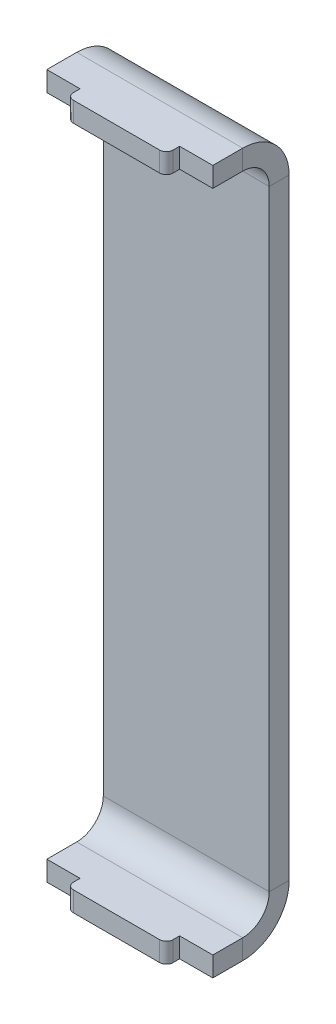
ISO-10303-21;
HEADER;
FILE_DESCRIPTION(('STEP AP214'),'2;1');
FILE_NAME('part.step','',(''),(''),'','','');
FILE_SCHEMA(('AUTOMOTIVE_DESIGN { 1 0 10303 214 1 1 1 1 }'));
ENDSEC;
DATA;
#1=APPLICATION_CONTEXT('core data for automotive mechanical design processes');
#2=APPLICATION_PROTOCOL_DEFINITION('international standard','automotive_design',2000,#1);
#3=PRODUCT_CONTEXT('',#1,'mechanical');
#4=PRODUCT('Part','Part','',(#3));
#5=PRODUCT_RELATED_PRODUCT_CATEGORY('part','',(#4));
#6=PRODUCT_DEFINITION_FORMATION('','',#4);
#7=PRODUCT_DEFINITION_CONTEXT('part definition',#1,'design');
#8=PRODUCT_DEFINITION('design','',#6,#7);
#9=PRODUCT_DEFINITION_SHAPE('','',#8);
#10=(LENGTH_UNIT() NAMED_UNIT(*) SI_UNIT(.MILLI.,.METRE.));
#11=(NAMED_UNIT(*) PLANE_ANGLE_UNIT() SI_UNIT($,.RADIAN.));
#12=(NAMED_UNIT(*) SI_UNIT($,.STERADIAN.) SOLID_ANGLE_UNIT());
#13=UNCERTAINTY_MEASURE_WITH_UNIT(LENGTH_MEASURE(1.E-05),#10,'distance_accuracy_value','');
#14=(GEOMETRIC_REPRESENTATION_CONTEXT(3) GLOBAL_UNCERTAINTY_ASSIGNED_CONTEXT((#13)) GLOBAL_UNIT_ASSIGNED_CONTEXT((#10,
#11,#12)) REPRESENTATION_CONTEXT('',''));
#15=CARTESIAN_POINT('',(0.,0.,0.));
#16=DIRECTION('',(0.,0.,1.));
#17=DIRECTION('',(1.,0.,0.));
#18=AXIS2_PLACEMENT_3D('',#15,#16,#17);
#19=CARTESIAN_POINT('',(0.,96.,-6.50000000000001));
#20=DIRECTION('',(-1.,0.,0.));
#21=DIRECTION('',(0.,0.,1.));
#22=AXIS2_PLACEMENT_3D('',#19,#20,#21);
#23=PLANE('',#22);
#24=DIRECTION('',(0.,0.,-1.));
#25=VECTOR('',#24,1.);
#26=CARTESIAN_POINT('',(0.,96.,-13.5));
#27=LINE('',#26,#25);
#28=CARTESIAN_POINT('',(0.,96.,-10.5));
#29=VERTEX_POINT('',#28);
#30=CARTESIAN_POINT('',(0.,96.,-13.5));
#31=VERTEX_POINT('',#30);
#32=EDGE_CURVE('E11',#29,#31,#27,.T.);
#33=ORIENTED_EDGE('',*,*,#32,.F.);
#34=CARTESIAN_POINT('',(0.,96.,-6.50000000000001));
#35=DIRECTION('',(-1.,0.,0.));
#36=DIRECTION('',(0.,0.,1.));
#37=AXIS2_PLACEMENT_3D('',#34,#35,#36);
#38=CIRCLE('',#37,4.);
#39=CARTESIAN_POINT('',(0.,100.,-6.50000000000002));
#40=VERTEX_POINT('',#39);
#41=EDGE_CURVE('E144',#29,#40,#38,.F.);
#42=ORIENTED_EDGE('',*,*,#41,.T.);
#43=DIRECTION('',(0.,1.,0.));
#44=VECTOR('',#43,1.);
#45=CARTESIAN_POINT('',(0.,103.,-6.50000000000001));
#46=LINE('',#45,#44);
#47=CARTESIAN_POINT('',(0.,103.,-6.50000000000001));
#48=VERTEX_POINT('',#47);
#49=EDGE_CURVE('E56',#40,#48,#46,.T.);
#50=ORIENTED_EDGE('',*,*,#49,.T.);
#51=CARTESIAN_POINT('',(0.,96.,-6.50000000000001));
#52=DIRECTION('',(1.,0.,0.));
#53=DIRECTION('',(0.,0.,-1.));
#54=AXIS2_PLACEMENT_3D('',#51,#52,#53);
#55=CIRCLE('',#54,7.);
#56=EDGE_CURVE('E147',#31,#48,#55,.T.);
#57=ORIENTED_EDGE('',*,*,#56,.F.);
#58=EDGE_LOOP('',(#33,#42,#50,#57));
#59=FACE_BOUND('',#58,.T.);
#60=ADVANCED_FACE('F45',(#59),#23,.T.);
#61=CARTESIAN_POINT('',(0.,103.,-10.5));
#62=DIRECTION('',(1.,0.,0.));
#63=DIRECTION('',(0.,0.,1.));
#64=AXIS2_PLACEMENT_3D('',#61,#62,#63);
#65=PLANE('',#64);
#66=ORIENTED_EDGE('',*,*,#49,.F.);
#67=DIRECTION('',(0.,0.,-1.));
#68=VECTOR('',#67,1.);
#69=CARTESIAN_POINT('',(0.,100.,-10.5));
#70=LINE('',#69,#68);
#71=CARTESIAN_POINT('',(0.,100.,-2.00000000000024));
#72=VERTEX_POINT('',#71);
#73=EDGE_CURVE('E398',#40,#72,#70,.F.);
#74=ORIENTED_EDGE('',*,*,#73,.T.);
#75=DIRECTION('',(0.,1.,0.));
#76=VECTOR('',#75,1.);
#77=CARTESIAN_POINT('',(0.,103.,-2.00000000000023));
#78=LINE('',#77,#76);
#79=CARTESIAN_POINT('',(0.,103.,-2.00000000000023));
#80=VERTEX_POINT('',#79);
#81=EDGE_CURVE('E268',#72,#80,#78,.T.);
#82=ORIENTED_EDGE('',*,*,#81,.T.);
#83=DIRECTION('',(0.,0.,1.));
#84=VECTOR('',#83,1.);
#85=CARTESIAN_POINT('',(0.,103.,-10.5));
#86=LINE('',#85,#84);
#87=EDGE_CURVE('E294',#48,#80,#86,.T.);
#88=ORIENTED_EDGE('',*,*,#87,.F.);
#89=EDGE_LOOP('',(#66,#74,#82,#88));
#90=FACE_BOUND('',#89,.T.);
#91=ADVANCED_FACE('F295',(#90),#65,.F.);
#92=CARTESIAN_POINT('',(0.,103.,-1.99999999999991));
#93=DIRECTION('',(0.,0.,1.));
#94=DIRECTION('',(-1.,0.,0.));
#95=AXIS2_PLACEMENT_3D('',#92,#93,#94);
#96=PLANE('',#95);
#97=ORIENTED_EDGE('',*,*,#81,.F.);
#98=DIRECTION('',(1.,0.,0.));
#99=VECTOR('',#98,1.);
#100=CARTESIAN_POINT('',(25.,100.,-2.00000000000024));
#101=LINE('',#100,#99);
#102=CARTESIAN_POINT('',(5.,100.,-2.00000000000024));
#103=VERTEX_POINT('',#102);
#104=EDGE_CURVE('E467',#103,#72,#101,.F.);
#105=ORIENTED_EDGE('',*,*,#104,.F.);
#106=DIRECTION('',(0.,1.,0.));
#107=VECTOR('',#106,1.);
#108=CARTESIAN_POINT('',(5.,103.,-2.00000000000023));
#109=LINE('',#108,#107);
#110=CARTESIAN_POINT('',(5.,103.,-2.00000000000023));
#111=VERTEX_POINT('',#110);
#112=EDGE_CURVE('E264',#103,#111,#109,.T.);
#113=ORIENTED_EDGE('',*,*,#112,.T.);
#114=DIRECTION('',(-1.,0.,0.));
#115=VECTOR('',#114,1.);
#116=CARTESIAN_POINT('',(0.,103.,-1.99999999999991));
#117=LINE('',#116,#115);
#118=EDGE_CURVE('E300',#111,#80,#117,.T.);
#119=ORIENTED_EDGE('',*,*,#118,.T.);
#120=EDGE_LOOP('',(#97,#105,#113,#119));
#121=FACE_BOUND('',#120,.T.);
#122=ADVANCED_FACE('F478',(#121),#96,.T.);
#123=CARTESIAN_POINT('',(5.,103.,4.08429320687734E-13));
#124=DIRECTION('',(-1.,0.,0.));
#125=DIRECTION('',(0.,0.,-1.));
#126=AXIS2_PLACEMENT_3D('',#123,#124,#125);
#127=PLANE('',#126);
#128=ORIENTED_EDGE('',*,*,#112,.F.);
#129=DIRECTION('',(0.,0.,-1.));
#130=VECTOR('',#129,1.);
#131=CARTESIAN_POINT('',(5.,100.,-10.5));
#132=LINE('',#131,#130);
#133=CARTESIAN_POINT('',(5.,100.,-1.00000000000001));
#134=VERTEX_POINT('',#133);
#135=EDGE_CURVE('E187',#134,#103,#132,.T.);
#136=ORIENTED_EDGE('',*,*,#135,.F.);
#137=DIRECTION('',(0.,1.,0.));
#138=VECTOR('',#137,1.);
#139=CARTESIAN_POINT('',(5.,103.,-1.));
#140=LINE('',#139,#138);
#141=CARTESIAN_POINT('',(5.,103.,-1.));
#142=VERTEX_POINT('',#141);
#143=EDGE_CURVE('E260',#134,#142,#140,.T.);
#144=ORIENTED_EDGE('',*,*,#143,.T.);
#145=DIRECTION('',(0.,0.,-1.));
#146=VECTOR('',#145,1.);
#147=CARTESIAN_POINT('',(5.,103.,4.08429320687734E-13));
#148=LINE('',#147,#146);
#149=EDGE_CURVE('E319',#142,#111,#148,.T.);
#150=ORIENTED_EDGE('',*,*,#149,.T.);
#151=EDGE_LOOP('',(#128,#136,#144,#150));
#152=FACE_BOUND('',#151,.T.);
#153=ADVANCED_FACE('F486',(#152),#127,.T.);
#154=CARTESIAN_POINT('',(6.,103.,-1.));
#155=DIRECTION('',(0.,-1.,0.));
#156=DIRECTION('',(0.,0.,-1.));
#157=AXIS2_PLACEMENT_3D('',#154,#155,#156);
#158=CYLINDRICAL_SURFACE('',#157,1.);
#159=ORIENTED_EDGE('',*,*,#143,.F.);
#160=CARTESIAN_POINT('',(6.,100.,-1.00000000000001));
#161=DIRECTION('',(0.,-1.,0.));
#162=DIRECTION('',(0.,0.,-1.));
#163=AXIS2_PLACEMENT_3D('',#160,#161,#162);
#164=CIRCLE('',#163,1.);
#165=CARTESIAN_POINT('',(6.,100.,0.));
#166=VERTEX_POINT('',#165);
#167=EDGE_CURVE('E182',#134,#166,#164,.F.);
#168=ORIENTED_EDGE('',*,*,#167,.T.);
#169=DIRECTION('',(0.,1.,0.));
#170=VECTOR('',#169,1.);
#171=CARTESIAN_POINT('',(6.,103.,0.));
#172=LINE('',#171,#170);
#173=CARTESIAN_POINT('',(6.,103.,0.));
#174=VERTEX_POINT('',#173);
#175=EDGE_CURVE('E256',#166,#174,#172,.T.);
#176=ORIENTED_EDGE('',*,*,#175,.T.);
#177=CARTESIAN_POINT('',(6.,103.,-1.));
#178=DIRECTION('',(0.,-1.,0.));
#179=DIRECTION('',(0.,0.,-1.));
#180=AXIS2_PLACEMENT_3D('',#177,#178,#179);
#181=CIRCLE('',#180,1.);
#182=EDGE_CURVE('E323',#142,#174,#181,.F.);
#183=ORIENTED_EDGE('',*,*,#182,.F.);
#184=EDGE_LOOP('',(#159,#168,#176,#183));
#185=FACE_BOUND('',#184,.T.);
#186=ADVANCED_FACE('F490',(#185),#158,.T.);
#187=CARTESIAN_POINT('',(25.,103.,0.));
#188=DIRECTION('',(0.,0.,1.));
#189=DIRECTION('',(-1.,0.,0.));
#190=AXIS2_PLACEMENT_3D('',#187,#188,#189);
#191=PLANE('',#190);
#192=ORIENTED_EDGE('',*,*,#175,.F.);
#193=DIRECTION('',(1.,0.,0.));
#194=VECTOR('',#193,1.);
#195=CARTESIAN_POINT('',(25.,100.,0.));
#196=LINE('',#195,#194);
#197=CARTESIAN_POINT('',(19.,100.,0.));
#198=VERTEX_POINT('',#197);
#199=EDGE_CURVE('E460',#198,#166,#196,.F.);
#200=ORIENTED_EDGE('',*,*,#199,.F.);
#201=DIRECTION('',(0.,1.,0.));
#202=VECTOR('',#201,1.);
#203=CARTESIAN_POINT('',(19.,103.,0.));
#204=LINE('',#203,#202);
#205=CARTESIAN_POINT('',(19.,103.,0.));
#206=VERTEX_POINT('',#205);
#207=EDGE_CURVE('E252',#198,#206,#204,.T.);
#208=ORIENTED_EDGE('',*,*,#207,.T.);
#209=DIRECTION('',(-1.,0.,0.));
#210=VECTOR('',#209,1.);
#211=CARTESIAN_POINT('',(25.,103.,0.));
#212=LINE('',#211,#210);
#213=EDGE_CURVE('E440',#206,#174,#212,.T.);
#214=ORIENTED_EDGE('',*,*,#213,.T.);
#215=EDGE_LOOP('',(#192,#200,#208,#214));
#216=FACE_BOUND('',#215,.T.);
#217=ADVANCED_FACE('F494',(#216),#191,.T.);
#218=CARTESIAN_POINT('',(19.,103.,-1.));
#219=DIRECTION('',(0.,-1.,0.));
#220=DIRECTION('',(0.,0.,-1.));
#221=AXIS2_PLACEMENT_3D('',#218,#219,#220);
#222=CYLINDRICAL_SURFACE('',#221,1.);
#223=ORIENTED_EDGE('',*,*,#207,.F.);
#224=CARTESIAN_POINT('',(19.,100.,-1.00000000000001));
#225=DIRECTION('',(0.,-1.,0.));
#226=DIRECTION('',(0.,0.,-1.));
#227=AXIS2_PLACEMENT_3D('',#224,#225,#226);
#228=CIRCLE('',#227,1.);
#229=CARTESIAN_POINT('',(20.,100.,-1.00000000000001));
#230=VERTEX_POINT('',#229);
#231=EDGE_CURVE('E456',#198,#230,#228,.F.);
#232=ORIENTED_EDGE('',*,*,#231,.T.);
#233=DIRECTION('',(0.,1.,0.));
#234=VECTOR('',#233,1.);
#235=CARTESIAN_POINT('',(20.,103.,-1.));
#236=LINE('',#235,#234);
#237=CARTESIAN_POINT('',(20.,103.,-1.));
#238=VERTEX_POINT('',#237);
#239=EDGE_CURVE('E248',#230,#238,#236,.T.);
#240=ORIENTED_EDGE('',*,*,#239,.T.);
#241=CARTESIAN_POINT('',(19.,103.,-1.));
#242=DIRECTION('',(0.,-1.,0.));
#243=DIRECTION('',(0.,0.,-1.));
#244=AXIS2_PLACEMENT_3D('',#241,#242,#243);
#245=CIRCLE('',#244,1.);
#246=EDGE_CURVE('E501',#206,#238,#245,.F.);
#247=ORIENTED_EDGE('',*,*,#246,.F.);
#248=EDGE_LOOP('',(#223,#232,#240,#247));
#249=FACE_BOUND('',#248,.T.);
#250=ADVANCED_FACE('F507',(#249),#222,.T.);
#251=CARTESIAN_POINT('',(20.,103.,4.08403469772825E-13));
#252=DIRECTION('',(1.,0.,0.));
#253=DIRECTION('',(0.,0.,1.));
#254=AXIS2_PLACEMENT_3D('',#251,#252,#253);
#255=PLANE('',#254);
#256=ORIENTED_EDGE('',*,*,#239,.F.);
#257=DIRECTION('',(0.,0.,-1.));
#258=VECTOR('',#257,1.);
#259=CARTESIAN_POINT('',(20.,100.,-10.5));
#260=LINE('',#259,#258);
#261=CARTESIAN_POINT('',(20.,100.,-2.00000000000024));
#262=VERTEX_POINT('',#261);
#263=EDGE_CURVE('E452',#262,#230,#260,.F.);
#264=ORIENTED_EDGE('',*,*,#263,.F.);
#265=DIRECTION('',(0.,1.,0.));
#266=VECTOR('',#265,1.);
#267=CARTESIAN_POINT('',(20.,103.,-2.00000000000023));
#268=LINE('',#267,#266);
#269=CARTESIAN_POINT('',(20.,103.,-2.00000000000023));
#270=VERTEX_POINT('',#269);
#271=EDGE_CURVE('E244',#262,#270,#268,.T.);
#272=ORIENTED_EDGE('',*,*,#271,.T.);
#273=DIRECTION('',(0.,0.,1.));
#274=VECTOR('',#273,1.);
#275=CARTESIAN_POINT('',(20.,103.,4.08403469772825E-13));
#276=LINE('',#275,#274);
#277=EDGE_CURVE('E509',#270,#238,#276,.T.);
#278=ORIENTED_EDGE('',*,*,#277,.T.);
#279=EDGE_LOOP('',(#256,#264,#272,#278));
#280=FACE_BOUND('',#279,.T.);
#281=ADVANCED_FACE('F631',(#280),#255,.T.);
#282=CARTESIAN_POINT('',(25.,103.,-1.99999999999991));
#283=DIRECTION('',(0.,0.,1.));
#284=DIRECTION('',(-1.,0.,0.));
#285=AXIS2_PLACEMENT_3D('',#282,#283,#284);
#286=PLANE('',#285);
#287=ORIENTED_EDGE('',*,*,#271,.F.);
#288=DIRECTION('',(1.,0.,0.));
#289=VECTOR('',#288,1.);
#290=CARTESIAN_POINT('',(25.,100.,-1.99999999999992));
#291=LINE('',#290,#289);
#292=CARTESIAN_POINT('',(25.,100.,-1.99999999999992));
#293=VERTEX_POINT('',#292);
#294=EDGE_CURVE('E448',#293,#262,#291,.F.);
#295=ORIENTED_EDGE('',*,*,#294,.F.);
#296=DIRECTION('',(0.,1.,0.));
#297=VECTOR('',#296,1.);
#298=CARTESIAN_POINT('',(25.,103.,-1.99999999999991));
#299=LINE('',#298,#297);
#300=CARTESIAN_POINT('',(25.,103.,-1.99999999999991));
#301=VERTEX_POINT('',#300);
#302=EDGE_CURVE('E240',#293,#301,#299,.T.);
#303=ORIENTED_EDGE('',*,*,#302,.T.);
#304=DIRECTION('',(-1.,0.,0.));
#305=VECTOR('',#304,1.);
#306=CARTESIAN_POINT('',(25.,103.,-1.99999999999991));
#307=LINE('',#306,#305);
#308=EDGE_CURVE('E313',#301,#270,#307,.T.);
#309=ORIENTED_EDGE('',*,*,#308,.T.);
#310=EDGE_LOOP('',(#287,#295,#303,#309));
#311=FACE_BOUND('',#310,.T.);
#312=ADVANCED_FACE('F519',(#311),#286,.T.);
#313=CARTESIAN_POINT('',(25.,103.,-10.5));
#314=DIRECTION('',(1.,0.,0.));
#315=DIRECTION('',(0.,0.,1.));
#316=AXIS2_PLACEMENT_3D('',#313,#314,#315);
#317=PLANE('',#316);
#318=ORIENTED_EDGE('',*,*,#302,.F.);
#319=DIRECTION('',(0.,0.,-1.));
#320=VECTOR('',#319,1.);
#321=CARTESIAN_POINT('',(25.,100.,-10.5));
#322=LINE('',#321,#320);
#323=CARTESIAN_POINT('',(25.,100.,-6.50000000000002));
#324=VERTEX_POINT('',#323);
#325=EDGE_CURVE('E399',#324,#293,#322,.F.);
#326=ORIENTED_EDGE('',*,*,#325,.F.);
#327=DIRECTION('',(0.,1.,0.));
#328=VECTOR('',#327,1.);
#329=CARTESIAN_POINT('',(25.,103.,-6.50000000000001));
#330=LINE('',#329,#328);
#331=CARTESIAN_POINT('',(25.,103.,-6.50000000000001));
#332=VERTEX_POINT('',#331);
#333=EDGE_CURVE('E236',#324,#332,#330,.T.);
#334=ORIENTED_EDGE('',*,*,#333,.T.);
#335=DIRECTION('',(0.,0.,1.));
#336=VECTOR('',#335,1.);
#337=CARTESIAN_POINT('',(25.,103.,-10.5));
#338=LINE('',#337,#336);
#339=EDGE_CURVE('E307',#332,#301,#338,.T.);
#340=ORIENTED_EDGE('',*,*,#339,.T.);
#341=EDGE_LOOP('',(#318,#326,#334,#340));
#342=FACE_BOUND('',#341,.T.);
#343=ADVANCED_FACE('F525',(#342),#317,.T.);
#344=CARTESIAN_POINT('',(25.,96.,-6.50000000000001));
#345=DIRECTION('',(-1.,0.,0.));
#346=DIRECTION('',(0.,0.,1.));
#347=AXIS2_PLACEMENT_3D('',#344,#345,#346);
#348=PLANE('',#347);
#349=ORIENTED_EDGE('',*,*,#333,.F.);
#350=CARTESIAN_POINT('',(25.,96.,-6.50000000000001));
#351=DIRECTION('',(-1.,0.,0.));
#352=DIRECTION('',(0.,0.,1.));
#353=AXIS2_PLACEMENT_3D('',#350,#351,#352);
#354=CIRCLE('',#353,4.);
#355=CARTESIAN_POINT('',(25.,96.,-10.5));
#356=VERTEX_POINT('',#355);
#357=EDGE_CURVE('E175',#356,#324,#354,.F.);
#358=ORIENTED_EDGE('',*,*,#357,.F.);
#359=DIRECTION('',(0.,0.,-1.));
#360=VECTOR('',#359,1.);
#361=CARTESIAN_POINT('',(25.,96.,-13.5));
#362=LINE('',#361,#360);
#363=CARTESIAN_POINT('',(25.,96.,-13.5));
#364=VERTEX_POINT('',#363);
#365=EDGE_CURVE('E232',#356,#364,#362,.T.);
#366=ORIENTED_EDGE('',*,*,#365,.T.);
#367=CARTESIAN_POINT('',(25.,96.,-6.50000000000001));
#368=DIRECTION('',(1.,0.,0.));
#369=DIRECTION('',(0.,0.,-1.));
#370=AXIS2_PLACEMENT_3D('',#367,#368,#369);
#371=CIRCLE('',#370,7.);
#372=EDGE_CURVE('E290',#364,#332,#371,.T.);
#373=ORIENTED_EDGE('',*,*,#372,.T.);
#374=EDGE_LOOP('',(#349,#358,#366,#373));
#375=FACE_BOUND('',#374,.T.);
#376=ADVANCED_FACE('F529',(#375),#348,.F.);
#377=CARTESIAN_POINT('',(25.,100.,-13.5));
#378=DIRECTION('',(1.,0.,0.));
#379=DIRECTION('',(0.,1.,0.));
#380=AXIS2_PLACEMENT_3D('',#377,#378,#379);
#381=PLANE('',#380);
#382=ORIENTED_EDGE('',*,*,#365,.F.);
#383=DIRECTION('',(0.,1.,0.));
#384=VECTOR('',#383,1.);
#385=CARTESIAN_POINT('',(25.,100.,-10.5));
#386=LINE('',#385,#384);
#387=CARTESIAN_POINT('',(25.,4.,-10.5));
#388=VERTEX_POINT('',#387);
#389=EDGE_CURVE('E163',#388,#356,#386,.T.);
#390=ORIENTED_EDGE('',*,*,#389,.F.);
#391=DIRECTION('',(0.,0.,-1.));
#392=VECTOR('',#391,1.);
#393=CARTESIAN_POINT('',(25.,4.,-13.5));
#394=LINE('',#393,#392);
#395=CARTESIAN_POINT('',(25.,4.,-13.5));
#396=VERTEX_POINT('',#395);
#397=EDGE_CURVE('E228',#388,#396,#394,.T.);
#398=ORIENTED_EDGE('',*,*,#397,.T.);
#399=DIRECTION('',(0.,1.,0.));
#400=VECTOR('',#399,1.);
#401=CARTESIAN_POINT('',(25.,100.,-13.5));
#402=LINE('',#401,#400);
#403=EDGE_CURVE('E332',#396,#364,#402,.T.);
#404=ORIENTED_EDGE('',*,*,#403,.T.);
#405=EDGE_LOOP('',(#382,#390,#398,#404));
#406=FACE_BOUND('',#405,.T.);
#407=ADVANCED_FACE('F535',(#406),#381,.T.);
#408=CARTESIAN_POINT('',(25.,4.,-6.50000000000001));
#409=DIRECTION('',(-1.,0.,0.));
#410=DIRECTION('',(0.,0.,1.));
#411=AXIS2_PLACEMENT_3D('',#408,#409,#410);
#412=PLANE('',#411);
#413=ORIENTED_EDGE('',*,*,#397,.F.);
#414=CARTESIAN_POINT('',(25.,4.,-6.50000000000001));
#415=DIRECTION('',(-1.,0.,0.));
#416=DIRECTION('',(0.,0.,1.));
#417=AXIS2_PLACEMENT_3D('',#414,#415,#416);
#418=CIRCLE('',#417,4.);
#419=CARTESIAN_POINT('',(25.,0.,-6.50000000000001));
#420=VERTEX_POINT('',#419);
#421=EDGE_CURVE('E403',#420,#388,#418,.F.);
#422=ORIENTED_EDGE('',*,*,#421,.F.);
#423=DIRECTION('',(0.,-1.,0.));
#424=VECTOR('',#423,1.);
#425=CARTESIAN_POINT('',(25.,-3.,-6.50000000000001));
#426=LINE('',#425,#424);
#427=CARTESIAN_POINT('',(25.,-3.,-6.50000000000001));
#428=VERTEX_POINT('',#427);
#429=EDGE_CURVE('E224',#420,#428,#426,.T.);
#430=ORIENTED_EDGE('',*,*,#429,.T.);
#431=CARTESIAN_POINT('',(25.,4.,-6.50000000000001));
#432=DIRECTION('',(1.,0.,0.));
#433=DIRECTION('',(0.,0.,-1.));
#434=AXIS2_PLACEMENT_3D('',#431,#432,#433);
#435=CIRCLE('',#434,7.);
#436=EDGE_CURVE('E384',#428,#396,#435,.T.);
#437=ORIENTED_EDGE('',*,*,#436,.T.);
#438=EDGE_LOOP('',(#413,#422,#430,#437));
#439=FACE_BOUND('',#438,.T.);
#440=ADVANCED_FACE('F603',(#439),#412,.F.);
#441=CARTESIAN_POINT('',(25.,-3.,-10.5));
#442=DIRECTION('',(1.,0.,0.));
#443=DIRECTION('',(0.,0.,-1.));
#444=AXIS2_PLACEMENT_3D('',#441,#442,#443);
#445=PLANE('',#444);
#446=ORIENTED_EDGE('',*,*,#429,.F.);
#447=DIRECTION('',(0.,0.,1.));
#448=VECTOR('',#447,1.);
#449=CARTESIAN_POINT('',(25.,0.,-10.5));
#450=LINE('',#449,#448);
#451=CARTESIAN_POINT('',(25.,0.,-2.00000000000072));
#452=VERTEX_POINT('',#451);
#453=EDGE_CURVE('E393',#452,#420,#450,.F.);
#454=ORIENTED_EDGE('',*,*,#453,.F.);
#455=DIRECTION('',(0.,-1.,0.));
#456=VECTOR('',#455,1.);
#457=CARTESIAN_POINT('',(25.,-3.,-2.00000000000072));
#458=LINE('',#457,#456);
#459=CARTESIAN_POINT('',(25.,-3.,-2.00000000000072));
#460=VERTEX_POINT('',#459);
#461=EDGE_CURVE('E220',#452,#460,#458,.T.);
#462=ORIENTED_EDGE('',*,*,#461,.T.);
#463=DIRECTION('',(0.,0.,-1.));
#464=VECTOR('',#463,1.);
#465=CARTESIAN_POINT('',(25.,-3.,-10.5));
#466=LINE('',#465,#464);
#467=EDGE_CURVE('E365',#460,#428,#466,.T.);
#468=ORIENTED_EDGE('',*,*,#467,.T.);
#469=EDGE_LOOP('',(#446,#454,#462,#468));
#470=FACE_BOUND('',#469,.T.);
#471=ADVANCED_FACE('F645',(#470),#445,.T.);
#472=CARTESIAN_POINT('',(25.,-3.00000000000004,-2.0000000000004));
#473=DIRECTION('',(0.,0.,-1.));
#474=DIRECTION('',(-1.,0.,0.));
#475=AXIS2_PLACEMENT_3D('',#472,#473,#474);
#476=PLANE('',#475);
#477=ORIENTED_EDGE('',*,*,#461,.F.);
#478=DIRECTION('',(1.,0.,0.));
#479=VECTOR('',#478,1.);
#480=CARTESIAN_POINT('',(25.,0.,-2.00000000000072));
#481=LINE('',#480,#479);
#482=CARTESIAN_POINT('',(20.,0.,-2.00000000000072));
#483=VERTEX_POINT('',#482);
#484=EDGE_CURVE('E430',#452,#483,#481,.F.);
#485=ORIENTED_EDGE('',*,*,#484,.T.);
#486=DIRECTION('',(0.,-1.,0.));
#487=VECTOR('',#486,1.);
#488=CARTESIAN_POINT('',(20.,-3.00000000000004,-2.00000000000072));
#489=LINE('',#488,#487);
#490=CARTESIAN_POINT('',(20.,-3.00000000000004,-2.00000000000072));
#491=VERTEX_POINT('',#490);
#492=EDGE_CURVE('E216',#483,#491,#489,.T.);
#493=ORIENTED_EDGE('',*,*,#492,.T.);
#494=DIRECTION('',(-1.,0.,0.));
#495=VECTOR('',#494,1.);
#496=CARTESIAN_POINT('',(25.,-3.00000000000004,-2.0000000000004));
#497=LINE('',#496,#495);
#498=EDGE_CURVE('E369',#460,#491,#497,.T.);
#499=ORIENTED_EDGE('',*,*,#498,.F.);
#500=EDGE_LOOP('',(#477,#485,#493,#499));
#501=FACE_BOUND('',#500,.T.);
#502=ADVANCED_FACE('F561',(#501),#476,.F.);
#503=CARTESIAN_POINT('',(20.,-3.00000000000006,0.));
#504=DIRECTION('',(-1.,0.,0.));
#505=DIRECTION('',(0.,0.,1.));
#506=AXIS2_PLACEMENT_3D('',#503,#504,#505);
#507=PLANE('',#506);
#508=ORIENTED_EDGE('',*,*,#492,.F.);
#509=DIRECTION('',(0.,0.,1.));
#510=VECTOR('',#509,1.);
#511=CARTESIAN_POINT('',(20.,0.,-10.5));
#512=LINE('',#511,#510);
#513=CARTESIAN_POINT('',(20.,0.,-1.));
#514=VERTEX_POINT('',#513);
#515=EDGE_CURVE('E426',#483,#514,#512,.T.);
#516=ORIENTED_EDGE('',*,*,#515,.T.);
#517=DIRECTION('',(0.,-1.,0.));
#518=VECTOR('',#517,1.);
#519=CARTESIAN_POINT('',(20.,-3.00000000000005,-1.));
#520=LINE('',#519,#518);
#521=CARTESIAN_POINT('',(20.,-3.00000000000005,-1.));
#522=VERTEX_POINT('',#521);
#523=EDGE_CURVE('E213',#514,#522,#520,.T.);
#524=ORIENTED_EDGE('',*,*,#523,.T.);
#525=DIRECTION('',(0.,0.,1.));
#526=VECTOR('',#525,1.);
#527=CARTESIAN_POINT('',(20.,-3.00000000000006,0.));
#528=LINE('',#527,#526);
#529=EDGE_CURVE('E373',#491,#522,#528,.T.);
#530=ORIENTED_EDGE('',*,*,#529,.F.);
#531=EDGE_LOOP('',(#508,#516,#524,#530));
#532=FACE_BOUND('',#531,.T.);
#533=ADVANCED_FACE('F570',(#532),#507,.F.);
#534=CARTESIAN_POINT('',(19.,-3.,-1.));
#535=DIRECTION('',(0.,1.,0.));
#536=DIRECTION('',(0.,0.,1.));
#537=AXIS2_PLACEMENT_3D('',#534,#535,#536);
#538=CYLINDRICAL_SURFACE('',#537,1.);
#539=ORIENTED_EDGE('',*,*,#523,.F.);
#540=CARTESIAN_POINT('',(19.,0.,-1.));
#541=DIRECTION('',(0.,1.,0.));
#542=DIRECTION('',(0.,0.,1.));
#543=AXIS2_PLACEMENT_3D('',#540,#541,#542);
#544=CIRCLE('',#543,1.);
#545=CARTESIAN_POINT('',(19.,0.,0.));
#546=VERTEX_POINT('',#545);
#547=EDGE_CURVE('E404',#514,#546,#544,.F.);
#548=ORIENTED_EDGE('',*,*,#547,.T.);
#549=DIRECTION('',(0.,-1.,0.));
#550=VECTOR('',#549,1.);
#551=CARTESIAN_POINT('',(19.,-3.,0.));
#552=LINE('',#551,#550);
#553=CARTESIAN_POINT('',(19.,-3.,0.));
#554=VERTEX_POINT('',#553);
#555=EDGE_CURVE('E64',#546,#554,#552,.T.);
#556=ORIENTED_EDGE('',*,*,#555,.T.);
#557=CARTESIAN_POINT('',(19.,-3.,-1.));
#558=DIRECTION('',(0.,1.,0.));
#559=DIRECTION('',(0.,0.,1.));
#560=AXIS2_PLACEMENT_3D('',#557,#558,#559);
#561=CIRCLE('',#560,1.);
#562=EDGE_CURVE('E377',#522,#554,#561,.F.);
#563=ORIENTED_EDGE('',*,*,#562,.F.);
#564=EDGE_LOOP('',(#539,#548,#556,#563));
#565=FACE_BOUND('',#564,.T.);
#566=ADVANCED_FACE('F572',(#565),#538,.T.);
#567=CARTESIAN_POINT('',(25.,-3.,0.));
#568=DIRECTION('',(0.,0.,-1.));
#569=DIRECTION('',(-1.,0.,0.));
#570=AXIS2_PLACEMENT_3D('',#567,#568,#569);
#571=PLANE('',#570);
#572=ORIENTED_EDGE('',*,*,#555,.F.);
#573=DIRECTION('',(1.,0.,0.));
#574=VECTOR('',#573,1.);
#575=CARTESIAN_POINT('',(25.,0.,0.));
#576=LINE('',#575,#574);
#577=CARTESIAN_POINT('',(6.,0.,0.));
#578=VERTEX_POINT('',#577);
#579=EDGE_CURVE('E420',#546,#578,#576,.F.);
#580=ORIENTED_EDGE('',*,*,#579,.T.);
#581=DIRECTION('',(0.,-1.,0.));
#582=VECTOR('',#581,1.);
#583=CARTESIAN_POINT('',(6.,-3.,0.));
#584=LINE('',#583,#582);
#585=CARTESIAN_POINT('',(6.,-3.,0.));
#586=VERTEX_POINT('',#585);
#587=EDGE_CURVE('E207',#578,#586,#584,.T.);
#588=ORIENTED_EDGE('',*,*,#587,.T.);
#589=DIRECTION('',(-1.,0.,0.));
#590=VECTOR('',#589,1.);
#591=CARTESIAN_POINT('',(25.,-3.,0.));
#592=LINE('',#591,#590);
#593=EDGE_CURVE('E341',#554,#586,#592,.T.);
#594=ORIENTED_EDGE('',*,*,#593,.F.);
#595=EDGE_LOOP('',(#572,#580,#588,#594));
#596=FACE_BOUND('',#595,.T.);
#597=ADVANCED_FACE('F579',(#596),#571,.F.);
#598=CARTESIAN_POINT('',(6.,-3.,-1.));
#599=DIRECTION('',(0.,1.,0.));
#600=DIRECTION('',(0.,0.,1.));
#601=AXIS2_PLACEMENT_3D('',#598,#599,#600);
#602=CYLINDRICAL_SURFACE('',#601,1.);
#603=ORIENTED_EDGE('',*,*,#587,.F.);
#604=CARTESIAN_POINT('',(6.,0.,-1.));
#605=DIRECTION('',(0.,1.,0.));
#606=DIRECTION('',(0.,0.,1.));
#607=AXIS2_PLACEMENT_3D('',#604,#605,#606);
#608=CIRCLE('',#607,1.);
#609=CARTESIAN_POINT('',(5.,0.,-1.));
#610=VERTEX_POINT('',#609);
#611=EDGE_CURVE('E416',#578,#610,#608,.F.);
#612=ORIENTED_EDGE('',*,*,#611,.T.);
#613=DIRECTION('',(0.,-1.,0.));
#614=VECTOR('',#613,1.);
#615=CARTESIAN_POINT('',(5.,-3.00000000000005,-1.));
#616=LINE('',#615,#614);
#617=CARTESIAN_POINT('',(5.,-3.00000000000005,-1.));
#618=VERTEX_POINT('',#617);
#619=EDGE_CURVE('E203',#610,#618,#616,.T.);
#620=ORIENTED_EDGE('',*,*,#619,.T.);
#621=CARTESIAN_POINT('',(6.,-3.,-1.));
#622=DIRECTION('',(0.,1.,0.));
#623=DIRECTION('',(0.,0.,1.));
#624=AXIS2_PLACEMENT_3D('',#621,#622,#623);
#625=CIRCLE('',#624,1.);
#626=EDGE_CURVE('E345',#586,#618,#625,.F.);
#627=ORIENTED_EDGE('',*,*,#626,.F.);
#628=EDGE_LOOP('',(#603,#612,#620,#627));
#629=FACE_BOUND('',#628,.T.);
#630=ADVANCED_FACE('F584',(#629),#602,.T.);
#631=CARTESIAN_POINT('',(5.,-3.00000000000006,0.));
#632=DIRECTION('',(1.,0.,0.));
#633=DIRECTION('',(0.,0.,-1.));
#634=AXIS2_PLACEMENT_3D('',#631,#632,#633);
#635=PLANE('',#634);
#636=ORIENTED_EDGE('',*,*,#619,.F.);
#637=DIRECTION('',(0.,0.,1.));
#638=VECTOR('',#637,1.);
#639=CARTESIAN_POINT('',(5.,0.,-10.5));
#640=LINE('',#639,#638);
#641=CARTESIAN_POINT('',(5.,0.,-2.00000000000072));
#642=VERTEX_POINT('',#641);
#643=EDGE_CURVE('E412',#610,#642,#640,.F.);
#644=ORIENTED_EDGE('',*,*,#643,.T.);
#645=DIRECTION('',(0.,-1.,0.));
#646=VECTOR('',#645,1.);
#647=CARTESIAN_POINT('',(5.,-3.,-2.00000000000072));
#648=LINE('',#647,#646);
#649=CARTESIAN_POINT('',(5.,-3.,-2.00000000000072));
#650=VERTEX_POINT('',#649);
#651=EDGE_CURVE('E199',#642,#650,#648,.T.);
#652=ORIENTED_EDGE('',*,*,#651,.T.);
#653=DIRECTION('',(0.,0.,-1.));
#654=VECTOR('',#653,1.);
#655=CARTESIAN_POINT('',(5.,-3.00000000000006,0.));
#656=LINE('',#655,#654);
#657=EDGE_CURVE('E349',#618,#650,#656,.T.);
#658=ORIENTED_EDGE('',*,*,#657,.F.);
#659=EDGE_LOOP('',(#636,#644,#652,#658));
#660=FACE_BOUND('',#659,.T.);
#661=ADVANCED_FACE('F586',(#660),#635,.F.);
#662=CARTESIAN_POINT('',(0.,-3.00000000000004,-2.0000000000004));
#663=DIRECTION('',(0.,0.,-1.));
#664=DIRECTION('',(-1.,0.,0.));
#665=AXIS2_PLACEMENT_3D('',#662,#663,#664);
#666=PLANE('',#665);
#667=ORIENTED_EDGE('',*,*,#651,.F.);
#668=DIRECTION('',(1.,0.,0.));
#669=VECTOR('',#668,1.);
#670=CARTESIAN_POINT('',(25.,0.,-2.00000000000072));
#671=LINE('',#670,#669);
#672=CARTESIAN_POINT('',(0.,0.,-2.0000000000004));
#673=VERTEX_POINT('',#672);
#674=EDGE_CURVE('E408',#642,#673,#671,.F.);
#675=ORIENTED_EDGE('',*,*,#674,.T.);
#676=DIRECTION('',(0.,-1.,0.));
#677=VECTOR('',#676,1.);
#678=CARTESIAN_POINT('',(0.,-3.00000000000004,-2.0000000000004));
#679=LINE('',#678,#677);
#680=CARTESIAN_POINT('',(0.,-3.00000000000004,-2.0000000000004));
#681=VERTEX_POINT('',#680);
#682=EDGE_CURVE('E195',#673,#681,#679,.T.);
#683=ORIENTED_EDGE('',*,*,#682,.T.);
#684=DIRECTION('',(-1.,0.,0.));
#685=VECTOR('',#684,1.);
#686=CARTESIAN_POINT('',(0.,-3.00000000000004,-2.0000000000004));
#687=LINE('',#686,#685);
#688=EDGE_CURVE('E353',#650,#681,#687,.T.);
#689=ORIENTED_EDGE('',*,*,#688,.F.);
#690=EDGE_LOOP('',(#667,#675,#683,#689));
#691=FACE_BOUND('',#690,.T.);
#692=ADVANCED_FACE('F590',(#691),#666,.F.);
#693=CARTESIAN_POINT('',(0.,-3.,-10.5));
#694=DIRECTION('',(1.,0.,0.));
#695=DIRECTION('',(0.,0.,-1.));
#696=AXIS2_PLACEMENT_3D('',#693,#694,#695);
#697=PLANE('',#696);
#698=ORIENTED_EDGE('',*,*,#682,.F.);
#699=DIRECTION('',(0.,0.,1.));
#700=VECTOR('',#699,1.);
#701=CARTESIAN_POINT('',(0.,0.,-10.5));
#702=LINE('',#701,#700);
#703=CARTESIAN_POINT('',(0.,0.,-6.50000000000001));
#704=VERTEX_POINT('',#703);
#705=EDGE_CURVE('E394',#673,#704,#702,.F.);
#706=ORIENTED_EDGE('',*,*,#705,.T.);
#707=DIRECTION('',(0.,-1.,0.));
#708=VECTOR('',#707,1.);
#709=CARTESIAN_POINT('',(0.,-3.,-6.50000000000001));
#710=LINE('',#709,#708);
#711=CARTESIAN_POINT('',(0.,-3.,-6.50000000000001));
#712=VERTEX_POINT('',#711);
#713=EDGE_CURVE('E191',#704,#712,#710,.T.);
#714=ORIENTED_EDGE('',*,*,#713,.T.);
#715=DIRECTION('',(0.,0.,-1.));
#716=VECTOR('',#715,1.);
#717=CARTESIAN_POINT('',(0.,-3.,-10.5));
#718=LINE('',#717,#716);
#719=EDGE_CURVE('E357',#681,#712,#718,.T.);
#720=ORIENTED_EDGE('',*,*,#719,.F.);
#721=EDGE_LOOP('',(#698,#706,#714,#720));
#722=FACE_BOUND('',#721,.T.);
#723=ADVANCED_FACE('F594',(#722),#697,.F.);
#724=CARTESIAN_POINT('',(0.,4.,-6.50000000000001));
#725=DIRECTION('',(-1.,0.,0.));
#726=DIRECTION('',(0.,0.,1.));
#727=AXIS2_PLACEMENT_3D('',#724,#725,#726);
#728=PLANE('',#727);
#729=ORIENTED_EDGE('',*,*,#713,.F.);
#730=CARTESIAN_POINT('',(0.,4.,-6.50000000000001));
#731=DIRECTION('',(-1.,0.,0.));
#732=DIRECTION('',(0.,0.,1.));
#733=AXIS2_PLACEMENT_3D('',#730,#731,#732);
#734=CIRCLE('',#733,4.);
#735=CARTESIAN_POINT('',(0.,4.,-10.5));
#736=VERTEX_POINT('',#735);
#737=EDGE_CURVE('E400',#704,#736,#734,.F.);
#738=ORIENTED_EDGE('',*,*,#737,.T.);
#739=DIRECTION('',(0.,0.,-1.));
#740=VECTOR('',#739,1.);
#741=CARTESIAN_POINT('',(0.,4.,-13.5));
#742=LINE('',#741,#740);
#743=CARTESIAN_POINT('',(0.,4.,-13.5));
#744=VERTEX_POINT('',#743);
#745=EDGE_CURVE('E49',#736,#744,#742,.T.);
#746=ORIENTED_EDGE('',*,*,#745,.T.);
#747=CARTESIAN_POINT('',(0.,4.,-6.50000000000001));
#748=DIRECTION('',(1.,0.,0.));
#749=DIRECTION('',(0.,0.,-1.));
#750=AXIS2_PLACEMENT_3D('',#747,#748,#749);
#751=CIRCLE('',#750,7.);
#752=EDGE_CURVE('E380',#712,#744,#751,.T.);
#753=ORIENTED_EDGE('',*,*,#752,.F.);
#754=EDGE_LOOP('',(#729,#738,#746,#753));
#755=FACE_BOUND('',#754,.T.);
#756=ADVANCED_FACE('F595',(#755),#728,.T.);
#757=CARTESIAN_POINT('',(0.,100.,-13.5));
#758=DIRECTION('',(1.,0.,0.));
#759=DIRECTION('',(0.,1.,0.));
#760=AXIS2_PLACEMENT_3D('',#757,#758,#759);
#761=PLANE('',#760);
#762=DIRECTION('',(0.,1.,0.));
#763=VECTOR('',#762,1.);
#764=CARTESIAN_POINT('',(0.,100.,-10.5));
#765=LINE('',#764,#763);
#766=EDGE_CURVE('E160',#736,#29,#765,.T.);
#767=ORIENTED_EDGE('',*,*,#766,.T.);
#768=ORIENTED_EDGE('',*,*,#32,.T.);
#769=DIRECTION('',(0.,1.,0.));
#770=VECTOR('',#769,1.);
#771=CARTESIAN_POINT('',(0.,100.,-13.5));
#772=LINE('',#771,#770);
#773=EDGE_CURVE('E327',#744,#31,#772,.T.);
#774=ORIENTED_EDGE('',*,*,#773,.F.);
#775=ORIENTED_EDGE('',*,*,#745,.F.);
#776=EDGE_LOOP('',(#767,#768,#774,#775));
#777=FACE_BOUND('',#776,.T.);
#778=ADVANCED_FACE('F47',(#777),#761,.F.);
#779=CARTESIAN_POINT('',(25.,4.,-6.50000000000001));
#780=DIRECTION('',(-1.,0.,0.));
#781=DIRECTION('',(0.,0.,1.));
#782=AXIS2_PLACEMENT_3D('',#779,#780,#781);
#783=CYLINDRICAL_SURFACE('',#782,7.);
#784=ORIENTED_EDGE('',*,*,#752,.T.);
#785=DIRECTION('',(-1.,0.,0.));
#786=VECTOR('',#785,1.);
#787=CARTESIAN_POINT('',(25.,4.,-13.5));
#788=LINE('',#787,#786);
#789=EDGE_CURVE('E291',#396,#744,#788,.T.);
#790=ORIENTED_EDGE('',*,*,#789,.F.);
#791=ORIENTED_EDGE('',*,*,#436,.F.);
#792=DIRECTION('',(-1.,0.,0.));
#793=VECTOR('',#792,1.);
#794=CARTESIAN_POINT('',(25.,-3.,-6.50000000000001));
#795=LINE('',#794,#793);
#796=EDGE_CURVE('E361',#428,#712,#795,.T.);
#797=ORIENTED_EDGE('',*,*,#796,.T.);
#798=EDGE_LOOP('',(#784,#790,#791,#797));
#799=FACE_BOUND('',#798,.T.);
#800=ADVANCED_FACE('F606',(#799),#783,.T.);
#801=CARTESIAN_POINT('',(25.,-3.,-10.5));
#802=DIRECTION('',(0.,1.,0.));
#803=DIRECTION('',(0.,0.,1.));
#804=AXIS2_PLACEMENT_3D('',#801,#802,#803);
#805=PLANE('',#804);
#806=ORIENTED_EDGE('',*,*,#593,.T.);
#807=ORIENTED_EDGE('',*,*,#626,.T.);
#808=ORIENTED_EDGE('',*,*,#657,.T.);
#809=ORIENTED_EDGE('',*,*,#688,.T.);
#810=ORIENTED_EDGE('',*,*,#719,.T.);
#811=ORIENTED_EDGE('',*,*,#796,.F.);
#812=ORIENTED_EDGE('',*,*,#467,.F.);
#813=ORIENTED_EDGE('',*,*,#498,.T.);
#814=ORIENTED_EDGE('',*,*,#529,.T.);
#815=ORIENTED_EDGE('',*,*,#562,.T.);
#816=EDGE_LOOP('',(#806,#807,#808,#809,#810,#811,#812,#813,#814,#815));
#817=FACE_BOUND('',#816,.T.);
#818=ADVANCED_FACE('F568',(#817),#805,.F.);
#819=CARTESIAN_POINT('',(25.,96.,-6.50000000000001));
#820=DIRECTION('',(-1.,0.,0.));
#821=DIRECTION('',(0.,0.,1.));
#822=AXIS2_PLACEMENT_3D('',#819,#820,#821);
#823=CYLINDRICAL_SURFACE('',#822,7.);
#824=ORIENTED_EDGE('',*,*,#56,.T.);
#825=DIRECTION('',(-1.,0.,0.));
#826=VECTOR('',#825,1.);
#827=CARTESIAN_POINT('',(25.,103.,-6.50000000000001));
#828=LINE('',#827,#826);
#829=EDGE_CURVE('E286',#332,#48,#828,.T.);
#830=ORIENTED_EDGE('',*,*,#829,.F.);
#831=ORIENTED_EDGE('',*,*,#372,.F.);
#832=DIRECTION('',(-1.,0.,0.));
#833=VECTOR('',#832,1.);
#834=CARTESIAN_POINT('',(25.,96.,-13.5));
#835=LINE('',#834,#833);
#836=EDGE_CURVE('E288',#364,#31,#835,.T.);
#837=ORIENTED_EDGE('',*,*,#836,.T.);
#838=EDGE_LOOP('',(#824,#830,#831,#837));
#839=FACE_BOUND('',#838,.T.);
#840=ADVANCED_FACE('F283',(#839),#823,.T.);
#841=CARTESIAN_POINT('',(25.,100.,-13.5));
#842=DIRECTION('',(0.,0.,1.));
#843=DIRECTION('',(1.,0.,0.));
#844=AXIS2_PLACEMENT_3D('',#841,#842,#843);
#845=PLANE('',#844);
#846=ORIENTED_EDGE('',*,*,#773,.T.);
#847=ORIENTED_EDGE('',*,*,#836,.F.);
#848=ORIENTED_EDGE('',*,*,#403,.F.);
#849=ORIENTED_EDGE('',*,*,#789,.T.);
#850=EDGE_LOOP('',(#846,#847,#848,#849));
#851=FACE_BOUND('',#850,.T.);
#852=ADVANCED_FACE('F537',(#851),#845,.F.);
#853=CARTESIAN_POINT('',(25.,103.,-10.5));
#854=DIRECTION('',(0.,-1.,0.));
#855=DIRECTION('',(0.,0.,-1.));
#856=AXIS2_PLACEMENT_3D('',#853,#854,#855);
#857=PLANE('',#856);
#858=ORIENTED_EDGE('',*,*,#213,.F.);
#859=ORIENTED_EDGE('',*,*,#246,.T.);
#860=ORIENTED_EDGE('',*,*,#277,.F.);
#861=ORIENTED_EDGE('',*,*,#308,.F.);
#862=ORIENTED_EDGE('',*,*,#339,.F.);
#863=ORIENTED_EDGE('',*,*,#829,.T.);
#864=ORIENTED_EDGE('',*,*,#87,.T.);
#865=ORIENTED_EDGE('',*,*,#118,.F.);
#866=ORIENTED_EDGE('',*,*,#149,.F.);
#867=ORIENTED_EDGE('',*,*,#182,.T.);
#868=EDGE_LOOP('',(#858,#859,#860,#861,#862,#863,#864,#865,#866,#867));
#869=FACE_BOUND('',#868,.T.);
#870=ADVANCED_FACE('F304',(#869),#857,.F.);
#871=CARTESIAN_POINT('',(25.,4.,-6.50000000000001));
#872=DIRECTION('',(-1.,0.,0.));
#873=DIRECTION('',(0.,0.,1.));
#874=AXIS2_PLACEMENT_3D('',#871,#872,#873);
#875=CYLINDRICAL_SURFACE('',#874,4.);
#876=ORIENTED_EDGE('',*,*,#737,.F.);
#877=DIRECTION('',(-1.,0.,0.));
#878=VECTOR('',#877,1.);
#879=CARTESIAN_POINT('',(25.,0.,-6.50000000000001));
#880=LINE('',#879,#878);
#881=EDGE_CURVE('E390',#420,#704,#880,.T.);
#882=ORIENTED_EDGE('',*,*,#881,.F.);
#883=ORIENTED_EDGE('',*,*,#421,.T.);
#884=DIRECTION('',(1.,0.,0.));
#885=VECTOR('',#884,1.);
#886=CARTESIAN_POINT('',(25.,4.,-10.5));
#887=LINE('',#886,#885);
#888=EDGE_CURVE('E176',#388,#736,#887,.F.);
#889=ORIENTED_EDGE('',*,*,#888,.T.);
#890=EDGE_LOOP('',(#876,#882,#883,#889));
#891=FACE_BOUND('',#890,.T.);
#892=ADVANCED_FACE('F601',(#891),#875,.F.);
#893=CARTESIAN_POINT('',(25.,0.,-10.5));
#894=DIRECTION('',(0.,1.,0.));
#895=DIRECTION('',(0.,0.,1.));
#896=AXIS2_PLACEMENT_3D('',#893,#894,#895);
#897=PLANE('',#896);
#898=ORIENTED_EDGE('',*,*,#579,.F.);
#899=ORIENTED_EDGE('',*,*,#547,.F.);
#900=ORIENTED_EDGE('',*,*,#515,.F.);
#901=ORIENTED_EDGE('',*,*,#484,.F.);
#902=ORIENTED_EDGE('',*,*,#453,.T.);
#903=ORIENTED_EDGE('',*,*,#881,.T.);
#904=ORIENTED_EDGE('',*,*,#705,.F.);
#905=ORIENTED_EDGE('',*,*,#674,.F.);
#906=ORIENTED_EDGE('',*,*,#643,.F.);
#907=ORIENTED_EDGE('',*,*,#611,.F.);
#908=EDGE_LOOP('',(#898,#899,#900,#901,#902,#903,#904,#905,#906,#907));
#909=FACE_BOUND('',#908,.T.);
#910=ADVANCED_FACE('F575',(#909),#897,.T.);
#911=CARTESIAN_POINT('',(25.,96.,-6.50000000000001));
#912=DIRECTION('',(-1.,0.,0.));
#913=DIRECTION('',(0.,0.,1.));
#914=AXIS2_PLACEMENT_3D('',#911,#912,#913);
#915=CYLINDRICAL_SURFACE('',#914,4.);
#916=ORIENTED_EDGE('',*,*,#41,.F.);
#917=DIRECTION('',(-1.,0.,0.));
#918=VECTOR('',#917,1.);
#919=CARTESIAN_POINT('',(25.,96.,-10.5));
#920=LINE('',#919,#918);
#921=EDGE_CURVE('E157',#356,#29,#920,.T.);
#922=ORIENTED_EDGE('',*,*,#921,.F.);
#923=ORIENTED_EDGE('',*,*,#357,.T.);
#924=DIRECTION('',(1.,0.,0.));
#925=VECTOR('',#924,1.);
#926=CARTESIAN_POINT('',(25.,100.,-6.50000000000002));
#927=LINE('',#926,#925);
#928=EDGE_CURVE('E172',#324,#40,#927,.F.);
#929=ORIENTED_EDGE('',*,*,#928,.T.);
#930=EDGE_LOOP('',(#916,#922,#923,#929));
#931=FACE_BOUND('',#930,.T.);
#932=ADVANCED_FACE('F170',(#931),#915,.F.);
#933=CARTESIAN_POINT('',(25.,100.,-10.5));
#934=DIRECTION('',(0.,0.,1.));
#935=DIRECTION('',(1.,0.,0.));
#936=AXIS2_PLACEMENT_3D('',#933,#934,#935);
#937=PLANE('',#936);
#938=ORIENTED_EDGE('',*,*,#766,.F.);
#939=ORIENTED_EDGE('',*,*,#888,.F.);
#940=ORIENTED_EDGE('',*,*,#389,.T.);
#941=ORIENTED_EDGE('',*,*,#921,.T.);
#942=EDGE_LOOP('',(#938,#939,#940,#941));
#943=FACE_BOUND('',#942,.T.);
#944=ADVANCED_FACE('F158',(#943),#937,.T.);
#945=CARTESIAN_POINT('',(25.,100.,-10.5));
#946=DIRECTION('',(0.,-1.,0.));
#947=DIRECTION('',(0.,0.,-1.));
#948=AXIS2_PLACEMENT_3D('',#945,#946,#947);
#949=PLANE('',#948);
#950=ORIENTED_EDGE('',*,*,#199,.T.);
#951=ORIENTED_EDGE('',*,*,#167,.F.);
#952=ORIENTED_EDGE('',*,*,#135,.T.);
#953=ORIENTED_EDGE('',*,*,#104,.T.);
#954=ORIENTED_EDGE('',*,*,#73,.F.);
#955=ORIENTED_EDGE('',*,*,#928,.F.);
#956=ORIENTED_EDGE('',*,*,#325,.T.);
#957=ORIENTED_EDGE('',*,*,#294,.T.);
#958=ORIENTED_EDGE('',*,*,#263,.T.);
#959=ORIENTED_EDGE('',*,*,#231,.F.);
#960=EDGE_LOOP('',(#950,#951,#952,#953,#954,#955,#956,#957,#958,#959));
#961=FACE_BOUND('',#960,.T.);
#962=ADVANCED_FACE('F473',(#961),#949,.T.);
#963=CLOSED_SHELL('',(#60,#91,#122,#153,#186,#217,#250,#281,#312,#343,#376,#407,#440,#471,#502,
#533,#566,#597,#630,#661,#692,#723,#756,#778,#800,#818,#840,#852,#870,#892,#910,#932,#944,#962));
#964=MANIFOLD_SOLID_BREP('B2',#963);
#965=ADVANCED_BREP_SHAPE_REPRESENTATION('',(#18,#964),#14);
#966=SHAPE_DEFINITION_REPRESENTATION(#9,#965);
ENDSEC;
END-ISO-10303-21;
